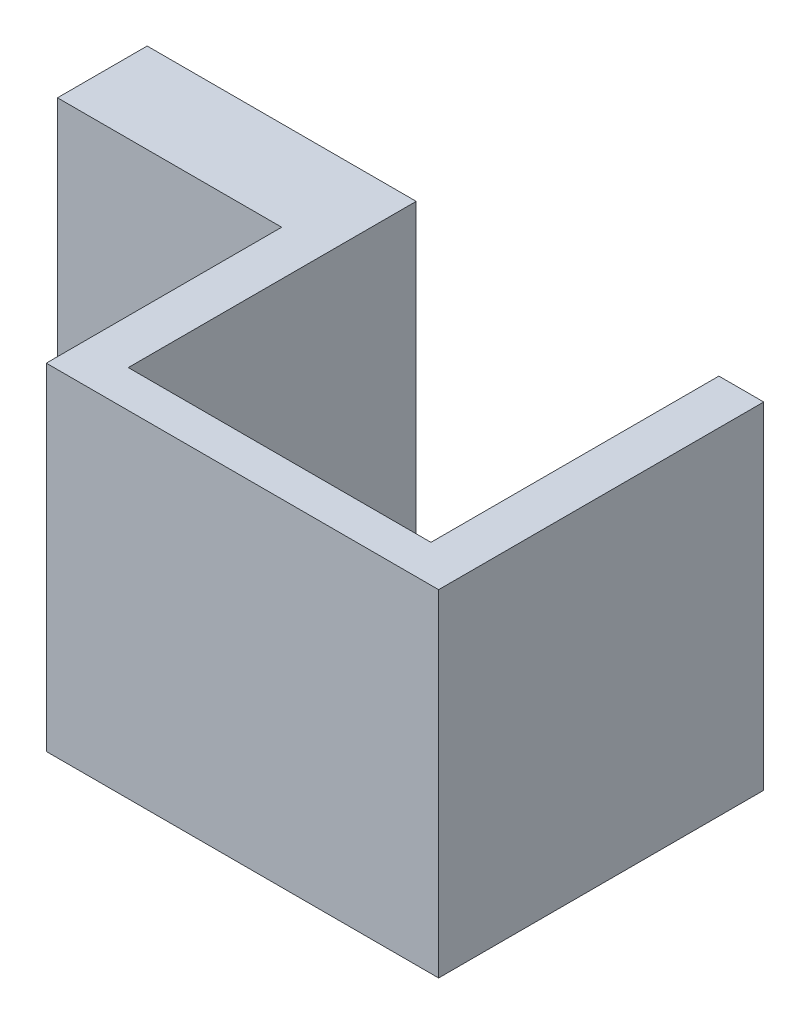
ISO-10303-21;
HEADER;
FILE_DESCRIPTION(('STEP AP214'),'2;1');
FILE_NAME('part.step','',(''),(''),'','','');
FILE_SCHEMA(('AUTOMOTIVE_DESIGN { 1 0 10303 214 1 1 1 1 }'));
ENDSEC;
DATA;
#1=APPLICATION_CONTEXT('core data for automotive mechanical design processes');
#2=APPLICATION_PROTOCOL_DEFINITION('international standard','automotive_design',2000,#1);
#3=PRODUCT_CONTEXT('',#1,'mechanical');
#4=PRODUCT('Part','Part','',(#3));
#5=PRODUCT_RELATED_PRODUCT_CATEGORY('part','',(#4));
#6=PRODUCT_DEFINITION_FORMATION('','',#4);
#7=PRODUCT_DEFINITION_CONTEXT('part definition',#1,'design');
#8=PRODUCT_DEFINITION('design','',#6,#7);
#9=PRODUCT_DEFINITION_SHAPE('','',#8);
#10=(LENGTH_UNIT() NAMED_UNIT(*) SI_UNIT(.MILLI.,.METRE.));
#11=(NAMED_UNIT(*) PLANE_ANGLE_UNIT() SI_UNIT($,.RADIAN.));
#12=(NAMED_UNIT(*) SI_UNIT($,.STERADIAN.) SOLID_ANGLE_UNIT());
#13=UNCERTAINTY_MEASURE_WITH_UNIT(LENGTH_MEASURE(1.E-05),#10,'distance_accuracy_value','');
#14=(GEOMETRIC_REPRESENTATION_CONTEXT(3) GLOBAL_UNCERTAINTY_ASSIGNED_CONTEXT((#13)) GLOBAL_UNIT_ASSIGNED_CONTEXT((#10,
#11,#12)) REPRESENTATION_CONTEXT('',''));
#15=CARTESIAN_POINT('',(0.,0.,0.));
#16=DIRECTION('',(0.,0.,1.));
#17=DIRECTION('',(1.,0.,0.));
#18=AXIS2_PLACEMENT_3D('',#15,#16,#17);
#19=CARTESIAN_POINT('',(6.75,15.,0.));
#20=DIRECTION('',(-1.,0.,0.));
#21=DIRECTION('',(0.,0.,1.));
#22=AXIS2_PLACEMENT_3D('',#19,#20,#21);
#23=PLANE('',#22);
#24=DIRECTION('',(0.,0.,-1.));
#25=VECTOR('',#24,1.);
#26=CARTESIAN_POINT('',(6.75,0.,0.));
#27=LINE('',#26,#25);
#28=CARTESIAN_POINT('',(6.75,0.,5.59285714285714));
#29=VERTEX_POINT('',#28);
#30=CARTESIAN_POINT('',(6.75,0.,-7.25));
#31=VERTEX_POINT('',#30);
#32=EDGE_CURVE('E140',#29,#31,#27,.T.);
#33=ORIENTED_EDGE('',*,*,#32,.F.);
#34=DIRECTION('',(0.,-1.,0.));
#35=VECTOR('',#34,1.);
#36=CARTESIAN_POINT('',(6.75,15.,5.59285714285714));
#37=LINE('',#36,#35);
#38=CARTESIAN_POINT('',(6.75,15.,5.59285714285714));
#39=VERTEX_POINT('',#38);
#40=EDGE_CURVE('E11',#39,#29,#37,.T.);
#41=ORIENTED_EDGE('',*,*,#40,.F.);
#42=DIRECTION('',(0.,0.,-1.));
#43=VECTOR('',#42,1.);
#44=CARTESIAN_POINT('',(6.75,15.,0.));
#45=LINE('',#44,#43);
#46=CARTESIAN_POINT('',(6.75,15.,-7.25));
#47=VERTEX_POINT('',#46);
#48=EDGE_CURVE('E199',#39,#47,#45,.T.);
#49=ORIENTED_EDGE('',*,*,#48,.T.);
#50=DIRECTION('',(0.,-1.,0.));
#51=VECTOR('',#50,1.);
#52=CARTESIAN_POINT('',(6.75,15.,-7.25));
#53=LINE('',#52,#51);
#54=EDGE_CURVE('E51',#47,#31,#53,.T.);
#55=ORIENTED_EDGE('',*,*,#54,.T.);
#56=EDGE_LOOP('',(#33,#41,#49,#55));
#57=FACE_BOUND('',#56,.T.);
#58=ADVANCED_FACE('F35',(#57),#23,.T.);
#59=CARTESIAN_POINT('',(0.,15.,5.59285714285714));
#60=DIRECTION('',(0.,0.,-1.));
#61=DIRECTION('',(-1.,0.,0.));
#62=AXIS2_PLACEMENT_3D('',#59,#60,#61);
#63=PLANE('',#62);
#64=DIRECTION('',(1.,0.,0.));
#65=VECTOR('',#64,1.);
#66=CARTESIAN_POINT('',(0.,0.,5.59285714285714));
#67=LINE('',#66,#65);
#68=CARTESIAN_POINT('',(-6.75,0.,5.59285714285714));
#69=VERTEX_POINT('',#68);
#70=EDGE_CURVE('E142',#69,#29,#67,.T.);
#71=ORIENTED_EDGE('',*,*,#70,.F.);
#72=DIRECTION('',(0.,-1.,0.));
#73=VECTOR('',#72,1.);
#74=CARTESIAN_POINT('',(-6.75,15.,5.59285714285714));
#75=LINE('',#74,#73);
#76=CARTESIAN_POINT('',(-6.75,15.,5.59285714285714));
#77=VERTEX_POINT('',#76);
#78=EDGE_CURVE('E43',#77,#69,#75,.T.);
#79=ORIENTED_EDGE('',*,*,#78,.F.);
#80=DIRECTION('',(1.,0.,0.));
#81=VECTOR('',#80,1.);
#82=CARTESIAN_POINT('',(0.,15.,5.59285714285714));
#83=LINE('',#82,#81);
#84=EDGE_CURVE('E196',#77,#39,#83,.T.);
#85=ORIENTED_EDGE('',*,*,#84,.T.);
#86=ORIENTED_EDGE('',*,*,#40,.T.);
#87=EDGE_LOOP('',(#71,#79,#85,#86));
#88=FACE_BOUND('',#87,.T.);
#89=ADVANCED_FACE('F185',(#88),#63,.T.);
#90=CARTESIAN_POINT('',(-6.75,15.,0.));
#91=DIRECTION('',(1.,0.,0.));
#92=DIRECTION('',(0.,0.,-1.));
#93=AXIS2_PLACEMENT_3D('',#90,#91,#92);
#94=PLANE('',#93);
#95=DIRECTION('',(0.,0.,1.));
#96=VECTOR('',#95,1.);
#97=CARTESIAN_POINT('',(-6.75,0.,0.));
#98=LINE('',#97,#96);
#99=CARTESIAN_POINT('',(-6.75,0.,-7.25));
#100=VERTEX_POINT('',#99);
#101=EDGE_CURVE('E146',#100,#69,#98,.T.);
#102=ORIENTED_EDGE('',*,*,#101,.F.);
#103=DIRECTION('',(0.,-1.,0.));
#104=VECTOR('',#103,1.);
#105=CARTESIAN_POINT('',(-6.75,15.,-7.25));
#106=LINE('',#105,#104);
#107=CARTESIAN_POINT('',(-6.75,15.,-7.25));
#108=VERTEX_POINT('',#107);
#109=EDGE_CURVE('E174',#108,#100,#106,.T.);
#110=ORIENTED_EDGE('',*,*,#109,.F.);
#111=DIRECTION('',(0.,0.,1.));
#112=VECTOR('',#111,1.);
#113=CARTESIAN_POINT('',(-6.75,15.,0.));
#114=LINE('',#113,#112);
#115=EDGE_CURVE('E181',#108,#77,#114,.T.);
#116=ORIENTED_EDGE('',*,*,#115,.T.);
#117=ORIENTED_EDGE('',*,*,#78,.T.);
#118=EDGE_LOOP('',(#102,#110,#116,#117));
#119=FACE_BOUND('',#118,.T.);
#120=ADVANCED_FACE('F179',(#119),#94,.T.);
#121=CARTESIAN_POINT('',(0.,15.,-7.25));
#122=DIRECTION('',(0.,0.,-1.));
#123=DIRECTION('',(-1.,0.,0.));
#124=AXIS2_PLACEMENT_3D('',#121,#122,#123);
#125=PLANE('',#124);
#126=CARTESIAN_POINT('',(-13.75,7.5,-7.25));
#127=DIRECTION('',(0.,0.,-1.));
#128=DIRECTION('',(-1.,0.,0.));
#129=AXIS2_PLACEMENT_3D('',#126,#127,#128);
#130=CIRCLE('',#129,1.5);
#131=CARTESIAN_POINT('',(-15.25,7.5,-7.25));
#132=VERTEX_POINT('',#131);
#133=EDGE_CURVE('E143',#132,#132,#130,.T.);
#134=ORIENTED_EDGE('',*,*,#133,.F.);
#135=EDGE_LOOP('',(#134));
#136=FACE_BOUND('',#135,.T.);
#137=DIRECTION('',(1.,0.,0.));
#138=VECTOR('',#137,1.);
#139=CARTESIAN_POINT('',(0.,0.,-7.25));
#140=LINE('',#139,#138);
#141=CARTESIAN_POINT('',(-18.75,0.,-7.25));
#142=VERTEX_POINT('',#141);
#143=EDGE_CURVE('E149',#142,#100,#140,.T.);
#144=ORIENTED_EDGE('',*,*,#143,.F.);
#145=DIRECTION('',(0.,-1.,0.));
#146=VECTOR('',#145,1.);
#147=CARTESIAN_POINT('',(-18.75,15.,-7.25));
#148=LINE('',#147,#146);
#149=CARTESIAN_POINT('',(-18.75,15.,-7.25));
#150=VERTEX_POINT('',#149);
#151=EDGE_CURVE('E172',#150,#142,#148,.T.);
#152=ORIENTED_EDGE('',*,*,#151,.F.);
#153=DIRECTION('',(1.,0.,0.));
#154=VECTOR('',#153,1.);
#155=CARTESIAN_POINT('',(0.,15.,-7.25));
#156=LINE('',#155,#154);
#157=EDGE_CURVE('E137',#150,#108,#156,.T.);
#158=ORIENTED_EDGE('',*,*,#157,.T.);
#159=ORIENTED_EDGE('',*,*,#109,.T.);
#160=EDGE_LOOP('',(#144,#152,#158,#159));
#161=FACE_BOUND('',#160,.T.);
#162=ADVANCED_FACE('F192',(#136,#161),#125,.T.);
#163=CARTESIAN_POINT('',(-18.75,15.,0.));
#164=DIRECTION('',(1.,0.,0.));
#165=DIRECTION('',(0.,0.,-1.));
#166=AXIS2_PLACEMENT_3D('',#163,#164,#165);
#167=PLANE('',#166);
#168=DIRECTION('',(0.,0.,1.));
#169=VECTOR('',#168,1.);
#170=CARTESIAN_POINT('',(-18.75,0.,0.));
#171=LINE('',#170,#169);
#172=CARTESIAN_POINT('',(-18.75,0.,-3.25));
#173=VERTEX_POINT('',#172);
#174=EDGE_CURVE('E152',#142,#173,#171,.T.);
#175=ORIENTED_EDGE('',*,*,#174,.T.);
#176=DIRECTION('',(0.,-1.,0.));
#177=VECTOR('',#176,1.);
#178=CARTESIAN_POINT('',(-18.75,15.,-3.25));
#179=LINE('',#178,#177);
#180=CARTESIAN_POINT('',(-18.75,15.,-3.25));
#181=VERTEX_POINT('',#180);
#182=EDGE_CURVE('E169',#181,#173,#179,.T.);
#183=ORIENTED_EDGE('',*,*,#182,.F.);
#184=DIRECTION('',(0.,0.,1.));
#185=VECTOR('',#184,1.);
#186=CARTESIAN_POINT('',(-18.75,15.,0.));
#187=LINE('',#186,#185);
#188=EDGE_CURVE('E198',#150,#181,#187,.T.);
#189=ORIENTED_EDGE('',*,*,#188,.F.);
#190=ORIENTED_EDGE('',*,*,#151,.T.);
#191=EDGE_LOOP('',(#175,#183,#189,#190));
#192=FACE_BOUND('',#191,.T.);
#193=ADVANCED_FACE('F222',(#192),#167,.F.);
#194=CARTESIAN_POINT('',(0.,15.,-3.25));
#195=DIRECTION('',(0.,0.,-1.));
#196=DIRECTION('',(-1.,0.,0.));
#197=AXIS2_PLACEMENT_3D('',#194,#195,#196);
#198=PLANE('',#197);
#199=CARTESIAN_POINT('',(-13.75,7.5,-3.25));
#200=DIRECTION('',(0.,0.,1.));
#201=DIRECTION('',(1.,0.,0.));
#202=AXIS2_PLACEMENT_3D('',#199,#200,#201);
#203=CIRCLE('',#202,1.5);
#204=CARTESIAN_POINT('',(-12.25,7.5,-3.25));
#205=VERTEX_POINT('',#204);
#206=EDGE_CURVE('E213',#205,#205,#203,.T.);
#207=ORIENTED_EDGE('',*,*,#206,.F.);
#208=EDGE_LOOP('',(#207));
#209=FACE_BOUND('',#208,.T.);
#210=DIRECTION('',(1.,0.,0.));
#211=VECTOR('',#210,1.);
#212=CARTESIAN_POINT('',(0.,0.,-3.25));
#213=LINE('',#212,#211);
#214=CARTESIAN_POINT('',(-8.75,0.,-3.25));
#215=VERTEX_POINT('',#214);
#216=EDGE_CURVE('E155',#173,#215,#213,.T.);
#217=ORIENTED_EDGE('',*,*,#216,.T.);
#218=DIRECTION('',(0.,-1.,0.));
#219=VECTOR('',#218,1.);
#220=CARTESIAN_POINT('',(-8.75,15.,-3.25));
#221=LINE('',#220,#219);
#222=CARTESIAN_POINT('',(-8.75,15.,-3.25));
#223=VERTEX_POINT('',#222);
#224=EDGE_CURVE('E167',#223,#215,#221,.T.);
#225=ORIENTED_EDGE('',*,*,#224,.F.);
#226=DIRECTION('',(1.,0.,0.));
#227=VECTOR('',#226,1.);
#228=CARTESIAN_POINT('',(0.,15.,-3.25));
#229=LINE('',#228,#227);
#230=EDGE_CURVE('E204',#181,#223,#229,.T.);
#231=ORIENTED_EDGE('',*,*,#230,.F.);
#232=ORIENTED_EDGE('',*,*,#182,.T.);
#233=EDGE_LOOP('',(#217,#225,#231,#232));
#234=FACE_BOUND('',#233,.T.);
#235=ADVANCED_FACE('F219',(#209,#234),#198,.F.);
#236=CARTESIAN_POINT('',(-8.75,15.,0.));
#237=DIRECTION('',(-1.,0.,0.));
#238=DIRECTION('',(0.,0.,1.));
#239=AXIS2_PLACEMENT_3D('',#236,#237,#238);
#240=PLANE('',#239);
#241=DIRECTION('',(0.,0.,-1.));
#242=VECTOR('',#241,1.);
#243=CARTESIAN_POINT('',(-8.75,0.,0.));
#244=LINE('',#243,#242);
#245=CARTESIAN_POINT('',(-8.75,0.,7.25));
#246=VERTEX_POINT('',#245);
#247=EDGE_CURVE('E158',#246,#215,#244,.T.);
#248=ORIENTED_EDGE('',*,*,#247,.F.);
#249=DIRECTION('',(0.,-1.,0.));
#250=VECTOR('',#249,1.);
#251=CARTESIAN_POINT('',(-8.75,15.,7.25));
#252=LINE('',#251,#250);
#253=CARTESIAN_POINT('',(-8.75,15.,7.25));
#254=VERTEX_POINT('',#253);
#255=EDGE_CURVE('E131',#254,#246,#252,.T.);
#256=ORIENTED_EDGE('',*,*,#255,.F.);
#257=DIRECTION('',(0.,0.,-1.));
#258=VECTOR('',#257,1.);
#259=CARTESIAN_POINT('',(-8.75,15.,0.));
#260=LINE('',#259,#258);
#261=EDGE_CURVE('E121',#254,#223,#260,.T.);
#262=ORIENTED_EDGE('',*,*,#261,.T.);
#263=ORIENTED_EDGE('',*,*,#224,.T.);
#264=EDGE_LOOP('',(#248,#256,#262,#263));
#265=FACE_BOUND('',#264,.T.);
#266=ADVANCED_FACE('F207',(#265),#240,.T.);
#267=CARTESIAN_POINT('',(0.,15.,7.25));
#268=DIRECTION('',(0.,0.,-1.));
#269=DIRECTION('',(-1.,0.,0.));
#270=AXIS2_PLACEMENT_3D('',#267,#268,#269);
#271=PLANE('',#270);
#272=DIRECTION('',(1.,0.,0.));
#273=VECTOR('',#272,1.);
#274=CARTESIAN_POINT('',(0.,0.,7.25));
#275=LINE('',#274,#273);
#276=CARTESIAN_POINT('',(8.75,0.,7.25));
#277=VERTEX_POINT('',#276);
#278=EDGE_CURVE('E128',#246,#277,#275,.T.);
#279=ORIENTED_EDGE('',*,*,#278,.T.);
#280=DIRECTION('',(0.,-1.,0.));
#281=VECTOR('',#280,1.);
#282=CARTESIAN_POINT('',(8.75,15.,7.25));
#283=LINE('',#282,#281);
#284=CARTESIAN_POINT('',(8.75,15.,7.25));
#285=VERTEX_POINT('',#284);
#286=EDGE_CURVE('E125',#285,#277,#283,.T.);
#287=ORIENTED_EDGE('',*,*,#286,.F.);
#288=DIRECTION('',(1.,0.,0.));
#289=VECTOR('',#288,1.);
#290=CARTESIAN_POINT('',(0.,15.,7.25));
#291=LINE('',#290,#289);
#292=EDGE_CURVE('E114',#254,#285,#291,.T.);
#293=ORIENTED_EDGE('',*,*,#292,.F.);
#294=ORIENTED_EDGE('',*,*,#255,.T.);
#295=EDGE_LOOP('',(#279,#287,#293,#294));
#296=FACE_BOUND('',#295,.T.);
#297=ADVANCED_FACE('F126',(#296),#271,.F.);
#298=CARTESIAN_POINT('',(8.75,15.,0.));
#299=DIRECTION('',(-1.,0.,0.));
#300=DIRECTION('',(0.,0.,1.));
#301=AXIS2_PLACEMENT_3D('',#298,#299,#300);
#302=PLANE('',#301);
#303=DIRECTION('',(0.,0.,-1.));
#304=VECTOR('',#303,1.);
#305=CARTESIAN_POINT('',(8.75,0.,0.));
#306=LINE('',#305,#304);
#307=CARTESIAN_POINT('',(8.75,0.,-7.25));
#308=VERTEX_POINT('',#307);
#309=EDGE_CURVE('E162',#277,#308,#306,.T.);
#310=ORIENTED_EDGE('',*,*,#309,.T.);
#311=DIRECTION('',(0.,-1.,0.));
#312=VECTOR('',#311,1.);
#313=CARTESIAN_POINT('',(8.75,15.,-7.25));
#314=LINE('',#313,#312);
#315=CARTESIAN_POINT('',(8.75,15.,-7.25));
#316=VERTEX_POINT('',#315);
#317=EDGE_CURVE('E83',#316,#308,#314,.T.);
#318=ORIENTED_EDGE('',*,*,#317,.F.);
#319=DIRECTION('',(0.,0.,-1.));
#320=VECTOR('',#319,1.);
#321=CARTESIAN_POINT('',(8.75,15.,0.));
#322=LINE('',#321,#320);
#323=EDGE_CURVE('E119',#285,#316,#322,.T.);
#324=ORIENTED_EDGE('',*,*,#323,.F.);
#325=ORIENTED_EDGE('',*,*,#286,.T.);
#326=EDGE_LOOP('',(#310,#318,#324,#325));
#327=FACE_BOUND('',#326,.T.);
#328=ADVANCED_FACE('F133',(#327),#302,.F.);
#329=EDGE_CURVE('E153',#31,#308,#140,.T.);
#330=ORIENTED_EDGE('',*,*,#329,.F.);
#331=ORIENTED_EDGE('',*,*,#54,.F.);
#332=EDGE_CURVE('E134',#47,#316,#156,.T.);
#333=ORIENTED_EDGE('',*,*,#332,.T.);
#334=ORIENTED_EDGE('',*,*,#317,.T.);
#335=EDGE_LOOP('',(#330,#331,#333,#334));
#336=FACE_BOUND('',#335,.T.);
#337=ADVANCED_FACE('F234',(#336),#125,.T.);
#338=CARTESIAN_POINT('',(0.,15.,0.));
#339=DIRECTION('',(0.,1.,0.));
#340=DIRECTION('',(0.,0.,1.));
#341=AXIS2_PLACEMENT_3D('',#338,#339,#340);
#342=PLANE('',#341);
#343=ORIENTED_EDGE('',*,*,#48,.F.);
#344=ORIENTED_EDGE('',*,*,#84,.F.);
#345=ORIENTED_EDGE('',*,*,#115,.F.);
#346=ORIENTED_EDGE('',*,*,#157,.F.);
#347=ORIENTED_EDGE('',*,*,#188,.T.);
#348=ORIENTED_EDGE('',*,*,#230,.T.);
#349=ORIENTED_EDGE('',*,*,#261,.F.);
#350=ORIENTED_EDGE('',*,*,#292,.T.);
#351=ORIENTED_EDGE('',*,*,#323,.T.);
#352=ORIENTED_EDGE('',*,*,#332,.F.);
#353=EDGE_LOOP('',(#343,#344,#345,#346,#347,#348,#349,#350,#351,#352));
#354=FACE_BOUND('',#353,.T.);
#355=ADVANCED_FACE('F116',(#354),#342,.T.);
#356=CARTESIAN_POINT('',(0.,0.,0.));
#357=DIRECTION('',(0.,1.,0.));
#358=DIRECTION('',(0.,0.,1.));
#359=AXIS2_PLACEMENT_3D('',#356,#357,#358);
#360=PLANE('',#359);
#361=ORIENTED_EDGE('',*,*,#32,.T.);
#362=ORIENTED_EDGE('',*,*,#329,.T.);
#363=ORIENTED_EDGE('',*,*,#309,.F.);
#364=ORIENTED_EDGE('',*,*,#278,.F.);
#365=ORIENTED_EDGE('',*,*,#247,.T.);
#366=ORIENTED_EDGE('',*,*,#216,.F.);
#367=ORIENTED_EDGE('',*,*,#174,.F.);
#368=ORIENTED_EDGE('',*,*,#143,.T.);
#369=ORIENTED_EDGE('',*,*,#101,.T.);
#370=ORIENTED_EDGE('',*,*,#70,.T.);
#371=EDGE_LOOP('',(#361,#362,#363,#364,#365,#366,#367,#368,#369,#370));
#372=FACE_BOUND('',#371,.T.);
#373=ADVANCED_FACE('F187',(#372),#360,.F.);
#374=CARTESIAN_POINT('',(-13.75,7.5,-18.25));
#375=DIRECTION('',(0.,0.,1.));
#376=DIRECTION('',(1.,0.,0.));
#377=AXIS2_PLACEMENT_3D('',#374,#375,#376);
#378=CYLINDRICAL_SURFACE('',#377,1.5);
#379=ORIENTED_EDGE('',*,*,#133,.T.);
#380=EDGE_LOOP('',(#379));
#381=FACE_BOUND('',#380,.T.);
#382=ORIENTED_EDGE('',*,*,#206,.T.);
#383=EDGE_LOOP('',(#382));
#384=FACE_BOUND('',#383,.T.);
#385=ADVANCED_FACE('F217',(#381,#384),#378,.F.);
#386=CLOSED_SHELL('',(#58,#89,#120,#162,#193,#235,#266,#297,#328,#337,#355,#373,#385));
#387=MANIFOLD_SOLID_BREP('B2',#386);
#388=ADVANCED_BREP_SHAPE_REPRESENTATION('',(#18,#387),#14);
#389=SHAPE_DEFINITION_REPRESENTATION(#9,#388);
ENDSEC;
END-ISO-10303-21;
